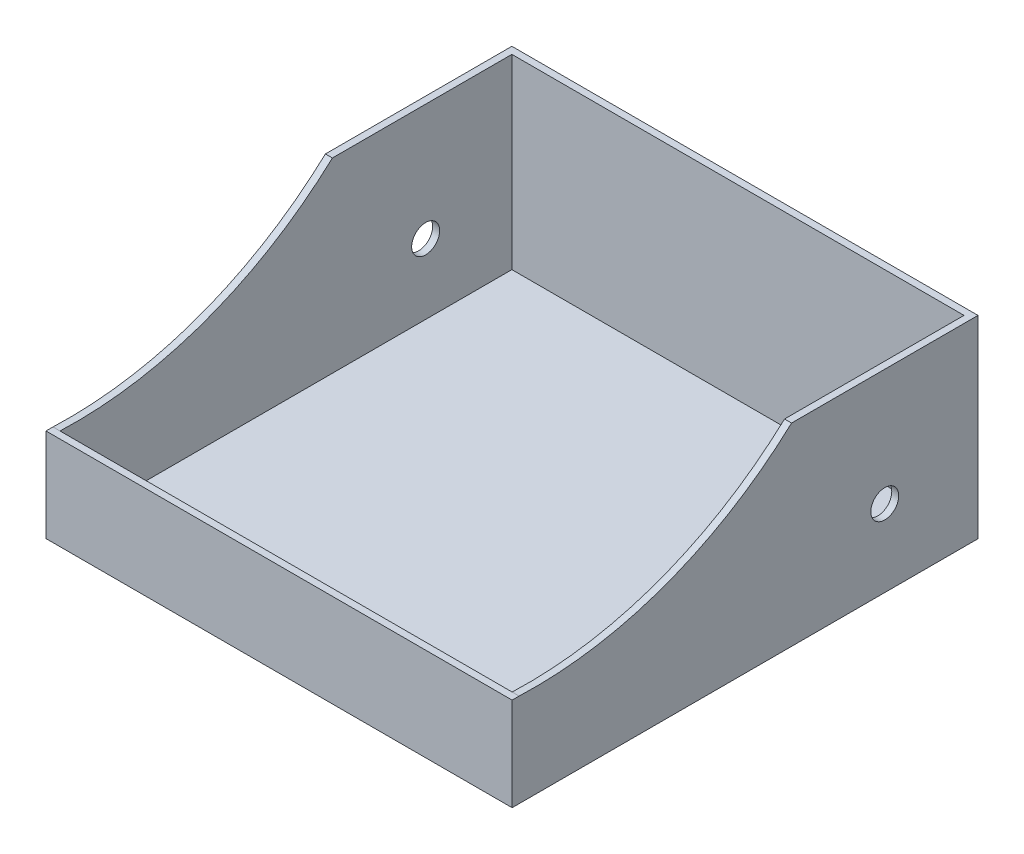
ISO-10303-21;
HEADER;
FILE_DESCRIPTION(('STEP AP214'),'2;1');
FILE_NAME('part.step','',(''),(''),'','','');
FILE_SCHEMA(('AUTOMOTIVE_DESIGN { 1 0 10303 214 1 1 1 1 }'));
ENDSEC;
DATA;
#1=APPLICATION_CONTEXT('core data for automotive mechanical design processes');
#2=APPLICATION_PROTOCOL_DEFINITION('international standard','automotive_design',2000,#1);
#3=PRODUCT_CONTEXT('',#1,'mechanical');
#4=PRODUCT('Part','Part','',(#3));
#5=PRODUCT_RELATED_PRODUCT_CATEGORY('part','',(#4));
#6=PRODUCT_DEFINITION_FORMATION('','',#4);
#7=PRODUCT_DEFINITION_CONTEXT('part definition',#1,'design');
#8=PRODUCT_DEFINITION('design','',#6,#7);
#9=PRODUCT_DEFINITION_SHAPE('','',#8);
#10=(LENGTH_UNIT() NAMED_UNIT(*) SI_UNIT(.MILLI.,.METRE.));
#11=(NAMED_UNIT(*) PLANE_ANGLE_UNIT() SI_UNIT($,.RADIAN.));
#12=(NAMED_UNIT(*) SI_UNIT($,.STERADIAN.) SOLID_ANGLE_UNIT());
#13=UNCERTAINTY_MEASURE_WITH_UNIT(LENGTH_MEASURE(1.E-05),#10,'distance_accuracy_value','');
#14=(GEOMETRIC_REPRESENTATION_CONTEXT(3) GLOBAL_UNCERTAINTY_ASSIGNED_CONTEXT((#13)) GLOBAL_UNIT_ASSIGNED_CONTEXT((#10,
#11,#12)) REPRESENTATION_CONTEXT('',''));
#15=CARTESIAN_POINT('',(0.,0.,0.));
#16=DIRECTION('',(0.,0.,1.));
#17=DIRECTION('',(1.,0.,0.));
#18=AXIS2_PLACEMENT_3D('',#15,#16,#17);
#19=CARTESIAN_POINT('',(0.,3.,0.));
#20=DIRECTION('',(0.,1.,0.));
#21=DIRECTION('',(0.,0.,1.));
#22=AXIS2_PLACEMENT_3D('',#19,#20,#21);
#23=PLANE('',#22);
#24=DIRECTION('',(0.,0.,1.));
#25=VECTOR('',#24,1.);
#26=CARTESIAN_POINT('',(97.,3.,-99.949));
#27=LINE('',#26,#25);
#28=CARTESIAN_POINT('',(97.,3.,-96.949));
#29=VERTEX_POINT('',#28);
#30=CARTESIAN_POINT('',(97.,3.,96.949));
#31=VERTEX_POINT('',#30);
#32=EDGE_CURVE('E209',#29,#31,#27,.T.);
#33=ORIENTED_EDGE('',*,*,#32,.F.);
#34=DIRECTION('',(-1.,0.,0.));
#35=VECTOR('',#34,1.);
#36=CARTESIAN_POINT('',(0.,3.,-96.949));
#37=LINE('',#36,#35);
#38=CARTESIAN_POINT('',(-97.,3.,-96.949));
#39=VERTEX_POINT('',#38);
#40=EDGE_CURVE('E139',#29,#39,#37,.T.);
#41=ORIENTED_EDGE('',*,*,#40,.T.);
#42=DIRECTION('',(0.,0.,-1.));
#43=VECTOR('',#42,1.);
#44=CARTESIAN_POINT('',(-97.,3.,-99.949));
#45=LINE('',#44,#43);
#46=CARTESIAN_POINT('',(-97.,3.,96.949));
#47=VERTEX_POINT('',#46);
#48=EDGE_CURVE('E137',#47,#39,#45,.T.);
#49=ORIENTED_EDGE('',*,*,#48,.F.);
#50=DIRECTION('',(1.,0.,0.));
#51=VECTOR('',#50,1.);
#52=CARTESIAN_POINT('',(0.,3.,96.949));
#53=LINE('',#52,#51);
#54=EDGE_CURVE('E206',#47,#31,#53,.T.);
#55=ORIENTED_EDGE('',*,*,#54,.T.);
#56=EDGE_LOOP('',(#33,#41,#49,#55));
#57=FACE_BOUND('',#56,.T.);
#58=ADVANCED_FACE('F39',(#57),#23,.T.);
#59=CARTESIAN_POINT('',(-97.,83.,-99.949));
#60=DIRECTION('',(-1.,0.,0.));
#61=DIRECTION('',(0.,0.,1.));
#62=AXIS2_PLACEMENT_3D('',#59,#60,#61);
#63=PLANE('',#62);
#64=CARTESIAN_POINT('',(-97.,33.,-59.949));
#65=DIRECTION('',(-1.,0.,0.));
#66=DIRECTION('',(0.,0.,1.));
#67=AXIS2_PLACEMENT_3D('',#64,#65,#66);
#68=CIRCLE('',#67,5.99999999999999);
#69=CARTESIAN_POINT('',(-97.,33.,-53.949));
#70=VERTEX_POINT('',#69);
#71=EDGE_CURVE('E138',#70,#70,#68,.T.);
#72=ORIENTED_EDGE('',*,*,#71,.T.);
#73=EDGE_LOOP('',(#72));
#74=FACE_BOUND('',#73,.T.);
#75=DIRECTION('',(0.,-1.,0.));
#76=VECTOR('',#75,1.);
#77=CARTESIAN_POINT('',(-97.,83.,-96.949));
#78=LINE('',#77,#76);
#79=CARTESIAN_POINT('',(-97.,83.,-96.949));
#80=VERTEX_POINT('',#79);
#81=EDGE_CURVE('E124',#80,#39,#78,.T.);
#82=ORIENTED_EDGE('',*,*,#81,.F.);
#83=DIRECTION('',(0.,0.,-1.));
#84=VECTOR('',#83,1.);
#85=CARTESIAN_POINT('',(-97.,83.,-99.949));
#86=LINE('',#85,#84);
#87=CARTESIAN_POINT('',(-97.,83.,-19.949));
#88=VERTEX_POINT('',#87);
#89=EDGE_CURVE('E135',#88,#80,#86,.T.);
#90=ORIENTED_EDGE('',*,*,#89,.F.);
#91=CARTESIAN_POINT('',(-97.,202.608368507145,90.4055915910214));
#92=DIRECTION('',(-1.,0.,0.));
#93=DIRECTION('',(0.,0.,1.));
#94=AXIS2_PLACEMENT_3D('',#91,#92,#93);
#95=CIRCLE('',#94,162.739969590024);
#96=CARTESIAN_POINT('',(-97.,40.,96.9489999999999));
#97=VERTEX_POINT('',#96);
#98=EDGE_CURVE('E226',#88,#97,#95,.T.);
#99=ORIENTED_EDGE('',*,*,#98,.T.);
#100=DIRECTION('',(0.,-1.,0.));
#101=VECTOR('',#100,1.);
#102=CARTESIAN_POINT('',(-97.,40.,96.949));
#103=LINE('',#102,#101);
#104=EDGE_CURVE('E235',#97,#47,#103,.T.);
#105=ORIENTED_EDGE('',*,*,#104,.T.);
#106=ORIENTED_EDGE('',*,*,#48,.T.);
#107=EDGE_LOOP('',(#82,#90,#99,#105,#106));
#108=FACE_BOUND('',#107,.T.);
#109=ADVANCED_FACE('F133',(#74,#108),#63,.F.);
#110=CARTESIAN_POINT('',(97.,83.,-99.949));
#111=DIRECTION('',(1.,0.,0.));
#112=DIRECTION('',(0.,0.,-1.));
#113=AXIS2_PLACEMENT_3D('',#110,#111,#112);
#114=PLANE('',#113);
#115=CARTESIAN_POINT('',(97.,33.,-59.949));
#116=DIRECTION('',(1.,0.,0.));
#117=DIRECTION('',(0.,0.,-1.));
#118=AXIS2_PLACEMENT_3D('',#115,#116,#117);
#119=CIRCLE('',#118,6.);
#120=CARTESIAN_POINT('',(97.,33.,-65.949));
#121=VERTEX_POINT('',#120);
#122=EDGE_CURVE('E43',#121,#121,#119,.T.);
#123=ORIENTED_EDGE('',*,*,#122,.T.);
#124=EDGE_LOOP('',(#123));
#125=FACE_BOUND('',#124,.T.);
#126=DIRECTION('',(0.,1.,0.));
#127=VECTOR('',#126,1.);
#128=CARTESIAN_POINT('',(97.,83.,-96.949));
#129=LINE('',#128,#127);
#130=CARTESIAN_POINT('',(97.,83.,-96.949));
#131=VERTEX_POINT('',#130);
#132=EDGE_CURVE('E127',#29,#131,#129,.T.);
#133=ORIENTED_EDGE('',*,*,#132,.F.);
#134=ORIENTED_EDGE('',*,*,#32,.T.);
#135=DIRECTION('',(0.,1.,0.));
#136=VECTOR('',#135,1.);
#137=CARTESIAN_POINT('',(97.,0.,96.949));
#138=LINE('',#137,#136);
#139=CARTESIAN_POINT('',(97.,40.,96.949));
#140=VERTEX_POINT('',#139);
#141=EDGE_CURVE('E227',#31,#140,#138,.T.);
#142=ORIENTED_EDGE('',*,*,#141,.T.);
#143=CARTESIAN_POINT('',(97.,202.608368507146,90.4055915910218));
#144=DIRECTION('',(1.,0.,0.));
#145=DIRECTION('',(0.,0.,-1.));
#146=AXIS2_PLACEMENT_3D('',#143,#144,#145);
#147=CIRCLE('',#146,162.739969590026);
#148=CARTESIAN_POINT('',(97.,83.,-19.949));
#149=VERTEX_POINT('',#148);
#150=EDGE_CURVE('E63',#149,#140,#147,.F.);
#151=ORIENTED_EDGE('',*,*,#150,.F.);
#152=DIRECTION('',(0.,0.,1.));
#153=VECTOR('',#152,1.);
#154=CARTESIAN_POINT('',(97.,83.,-99.949));
#155=LINE('',#154,#153);
#156=EDGE_CURVE('E218',#131,#149,#155,.T.);
#157=ORIENTED_EDGE('',*,*,#156,.F.);
#158=EDGE_LOOP('',(#133,#134,#142,#151,#157));
#159=FACE_BOUND('',#158,.T.);
#160=ADVANCED_FACE('F273',(#125,#159),#114,.F.);
#161=CARTESIAN_POINT('',(100.,40.,96.949));
#162=DIRECTION('',(0.,0.,1.));
#163=DIRECTION('',(1.,0.,0.));
#164=AXIS2_PLACEMENT_3D('',#161,#162,#163);
#165=PLANE('',#164);
#166=ORIENTED_EDGE('',*,*,#141,.F.);
#167=ORIENTED_EDGE('',*,*,#54,.F.);
#168=ORIENTED_EDGE('',*,*,#104,.F.);
#169=DIRECTION('',(-1.,0.,0.));
#170=VECTOR('',#169,1.);
#171=CARTESIAN_POINT('',(100.,40.,96.949));
#172=LINE('',#171,#170);
#173=EDGE_CURVE('E197',#140,#97,#172,.T.);
#174=ORIENTED_EDGE('',*,*,#173,.F.);
#175=EDGE_LOOP('',(#166,#167,#168,#174));
#176=FACE_BOUND('',#175,.T.);
#177=ADVANCED_FACE('F243',(#176),#165,.F.);
#178=CARTESIAN_POINT('',(100.,3.,-99.949));
#179=DIRECTION('',(-1.,0.,0.));
#180=DIRECTION('',(0.,0.,1.));
#181=AXIS2_PLACEMENT_3D('',#178,#179,#180);
#182=PLANE('',#181);
#183=DIRECTION('',(0.,-1.,0.));
#184=VECTOR('',#183,1.);
#185=CARTESIAN_POINT('',(100.,3.,-99.949));
#186=LINE('',#185,#184);
#187=CARTESIAN_POINT('',(100.,83.,-99.949));
#188=VERTEX_POINT('',#187);
#189=CARTESIAN_POINT('',(100.,0.,-99.949));
#190=VERTEX_POINT('',#189);
#191=EDGE_CURVE('E11',#188,#190,#186,.T.);
#192=ORIENTED_EDGE('',*,*,#191,.F.);
#193=DIRECTION('',(0.,0.,-1.));
#194=VECTOR('',#193,1.);
#195=CARTESIAN_POINT('',(100.,83.,-99.949));
#196=LINE('',#195,#194);
#197=CARTESIAN_POINT('',(100.,83.,-19.949));
#198=VERTEX_POINT('',#197);
#199=EDGE_CURVE('E215',#198,#188,#196,.T.);
#200=ORIENTED_EDGE('',*,*,#199,.F.);
#201=CARTESIAN_POINT('',(100.,202.608368507146,90.4055915910218));
#202=DIRECTION('',(1.,0.,0.));
#203=DIRECTION('',(0.,0.,-1.));
#204=AXIS2_PLACEMENT_3D('',#201,#202,#203);
#205=CIRCLE('',#204,162.739969590026);
#206=CARTESIAN_POINT('',(100.,40.,96.949));
#207=VERTEX_POINT('',#206);
#208=EDGE_CURVE('E194',#198,#207,#205,.F.);
#209=ORIENTED_EDGE('',*,*,#208,.T.);
#210=DIRECTION('',(0.,0.,-1.));
#211=VECTOR('',#210,1.);
#212=CARTESIAN_POINT('',(100.,40.,99.949));
#213=LINE('',#212,#211);
#214=CARTESIAN_POINT('',(100.,40.,99.949));
#215=VERTEX_POINT('',#214);
#216=EDGE_CURVE('E191',#215,#207,#213,.T.);
#217=ORIENTED_EDGE('',*,*,#216,.F.);
#218=DIRECTION('',(0.,-1.,0.));
#219=VECTOR('',#218,1.);
#220=CARTESIAN_POINT('',(100.,3.,99.949));
#221=LINE('',#220,#219);
#222=CARTESIAN_POINT('',(100.,0.,99.949));
#223=VERTEX_POINT('',#222);
#224=EDGE_CURVE('E163',#215,#223,#221,.T.);
#225=ORIENTED_EDGE('',*,*,#224,.T.);
#226=DIRECTION('',(0.,0.,-1.));
#227=VECTOR('',#226,1.);
#228=CARTESIAN_POINT('',(100.,0.,-99.949));
#229=LINE('',#228,#227);
#230=EDGE_CURVE('E148',#223,#190,#229,.T.);
#231=ORIENTED_EDGE('',*,*,#230,.T.);
#232=EDGE_LOOP('',(#192,#200,#209,#217,#225,#231));
#233=FACE_BOUND('',#232,.T.);
#234=CARTESIAN_POINT('',(100.,33.,-59.949));
#235=DIRECTION('',(-1.,0.,0.));
#236=DIRECTION('',(0.,0.,1.));
#237=AXIS2_PLACEMENT_3D('',#234,#235,#236);
#238=CIRCLE('',#237,6.);
#239=CARTESIAN_POINT('',(100.,33.,-53.949));
#240=VERTEX_POINT('',#239);
#241=EDGE_CURVE('E198',#240,#240,#238,.T.);
#242=ORIENTED_EDGE('',*,*,#241,.T.);
#243=EDGE_LOOP('',(#242));
#244=FACE_BOUND('',#243,.T.);
#245=ADVANCED_FACE('F41',(#233,#244),#182,.F.);
#246=CARTESIAN_POINT('',(-100.,3.,-99.949));
#247=DIRECTION('',(0.,0.,1.));
#248=DIRECTION('',(1.,0.,0.));
#249=AXIS2_PLACEMENT_3D('',#246,#247,#248);
#250=PLANE('',#249);
#251=DIRECTION('',(-1.,0.,0.));
#252=VECTOR('',#251,1.);
#253=CARTESIAN_POINT('',(-100.,83.,-99.949));
#254=LINE('',#253,#252);
#255=CARTESIAN_POINT('',(-100.,83.,-99.949));
#256=VERTEX_POINT('',#255);
#257=EDGE_CURVE('E145',#188,#256,#254,.T.);
#258=ORIENTED_EDGE('',*,*,#257,.F.);
#259=ORIENTED_EDGE('',*,*,#191,.T.);
#260=DIRECTION('',(-1.,0.,0.));
#261=VECTOR('',#260,1.);
#262=CARTESIAN_POINT('',(-100.,0.,-99.949));
#263=LINE('',#262,#261);
#264=CARTESIAN_POINT('',(-100.,0.,-99.949));
#265=VERTEX_POINT('',#264);
#266=EDGE_CURVE('E157',#190,#265,#263,.T.);
#267=ORIENTED_EDGE('',*,*,#266,.T.);
#268=DIRECTION('',(0.,-1.,0.));
#269=VECTOR('',#268,1.);
#270=CARTESIAN_POINT('',(-100.,3.,-99.949));
#271=LINE('',#270,#269);
#272=EDGE_CURVE('E48',#256,#265,#271,.T.);
#273=ORIENTED_EDGE('',*,*,#272,.F.);
#274=EDGE_LOOP('',(#258,#259,#267,#273));
#275=FACE_BOUND('',#274,.T.);
#276=ADVANCED_FACE('F283',(#275),#250,.F.);
#277=CARTESIAN_POINT('',(-100.,3.,-99.949));
#278=DIRECTION('',(1.,0.,0.));
#279=DIRECTION('',(0.,0.,-1.));
#280=AXIS2_PLACEMENT_3D('',#277,#278,#279);
#281=PLANE('',#280);
#282=DIRECTION('',(0.,0.,1.));
#283=VECTOR('',#282,1.);
#284=CARTESIAN_POINT('',(-100.,0.,-99.949));
#285=LINE('',#284,#283);
#286=CARTESIAN_POINT('',(-100.,0.,99.949));
#287=VERTEX_POINT('',#286);
#288=EDGE_CURVE('E159',#265,#287,#285,.T.);
#289=ORIENTED_EDGE('',*,*,#288,.T.);
#290=DIRECTION('',(0.,-1.,0.));
#291=VECTOR('',#290,1.);
#292=CARTESIAN_POINT('',(-100.,3.,99.949));
#293=LINE('',#292,#291);
#294=CARTESIAN_POINT('',(-100.,40.,99.949));
#295=VERTEX_POINT('',#294);
#296=EDGE_CURVE('E166',#295,#287,#293,.T.);
#297=ORIENTED_EDGE('',*,*,#296,.F.);
#298=DIRECTION('',(0.,0.,-1.));
#299=VECTOR('',#298,1.);
#300=CARTESIAN_POINT('',(-100.,40.,99.949));
#301=LINE('',#300,#299);
#302=CARTESIAN_POINT('',(-100.,40.,96.949));
#303=VERTEX_POINT('',#302);
#304=EDGE_CURVE('E205',#295,#303,#301,.T.);
#305=ORIENTED_EDGE('',*,*,#304,.T.);
#306=CARTESIAN_POINT('',(-100.,202.608368507145,90.4055915910214));
#307=DIRECTION('',(-1.,0.,0.));
#308=DIRECTION('',(0.,0.,1.));
#309=AXIS2_PLACEMENT_3D('',#306,#307,#308);
#310=CIRCLE('',#309,162.739969590024);
#311=CARTESIAN_POINT('',(-100.,83.,-19.949));
#312=VERTEX_POINT('',#311);
#313=EDGE_CURVE('E225',#312,#303,#310,.T.);
#314=ORIENTED_EDGE('',*,*,#313,.F.);
#315=DIRECTION('',(0.,0.,1.));
#316=VECTOR('',#315,1.);
#317=CARTESIAN_POINT('',(-100.,83.,-99.949));
#318=LINE('',#317,#316);
#319=EDGE_CURVE('E150',#256,#312,#318,.T.);
#320=ORIENTED_EDGE('',*,*,#319,.F.);
#321=ORIENTED_EDGE('',*,*,#272,.T.);
#322=EDGE_LOOP('',(#289,#297,#305,#314,#320,#321));
#323=FACE_BOUND('',#322,.T.);
#324=CARTESIAN_POINT('',(-100.,33.,-59.949));
#325=DIRECTION('',(1.,0.,0.));
#326=DIRECTION('',(0.,0.,-1.));
#327=AXIS2_PLACEMENT_3D('',#324,#325,#326);
#328=CIRCLE('',#327,5.99999999999999);
#329=CARTESIAN_POINT('',(-100.,33.,-65.949));
#330=VERTEX_POINT('',#329);
#331=EDGE_CURVE('E251',#330,#330,#328,.T.);
#332=ORIENTED_EDGE('',*,*,#331,.T.);
#333=EDGE_LOOP('',(#332));
#334=FACE_BOUND('',#333,.T.);
#335=ADVANCED_FACE('F173',(#323,#334),#281,.F.);
#336=CARTESIAN_POINT('',(-100.,3.,99.949));
#337=DIRECTION('',(0.,0.,-1.));
#338=DIRECTION('',(-1.,0.,0.));
#339=AXIS2_PLACEMENT_3D('',#336,#337,#338);
#340=PLANE('',#339);
#341=DIRECTION('',(1.,0.,0.));
#342=VECTOR('',#341,1.);
#343=CARTESIAN_POINT('',(-100.,0.,99.949));
#344=LINE('',#343,#342);
#345=EDGE_CURVE('E161',#287,#223,#344,.T.);
#346=ORIENTED_EDGE('',*,*,#345,.T.);
#347=ORIENTED_EDGE('',*,*,#224,.F.);
#348=DIRECTION('',(-1.,0.,0.));
#349=VECTOR('',#348,1.);
#350=CARTESIAN_POINT('',(100.,40.,99.949));
#351=LINE('',#350,#349);
#352=EDGE_CURVE('E201',#215,#295,#351,.T.);
#353=ORIENTED_EDGE('',*,*,#352,.T.);
#354=ORIENTED_EDGE('',*,*,#296,.T.);
#355=EDGE_LOOP('',(#346,#347,#353,#354));
#356=FACE_BOUND('',#355,.T.);
#357=ADVANCED_FACE('F184',(#356),#340,.F.);
#358=CARTESIAN_POINT('',(0.,0.,0.));
#359=DIRECTION('',(0.,1.,0.));
#360=DIRECTION('',(0.,0.,1.));
#361=AXIS2_PLACEMENT_3D('',#358,#359,#360);
#362=PLANE('',#361);
#363=ORIENTED_EDGE('',*,*,#266,.F.);
#364=ORIENTED_EDGE('',*,*,#230,.F.);
#365=ORIENTED_EDGE('',*,*,#345,.F.);
#366=ORIENTED_EDGE('',*,*,#288,.F.);
#367=EDGE_LOOP('',(#363,#364,#365,#366));
#368=FACE_BOUND('',#367,.T.);
#369=ADVANCED_FACE('F181',(#368),#362,.F.);
#370=CARTESIAN_POINT('',(0.,83.,0.));
#371=DIRECTION('',(0.,1.,0.));
#372=DIRECTION('',(0.,0.,1.));
#373=AXIS2_PLACEMENT_3D('',#370,#371,#372);
#374=PLANE('',#373);
#375=ORIENTED_EDGE('',*,*,#319,.T.);
#376=DIRECTION('',(1.,0.,0.));
#377=VECTOR('',#376,1.);
#378=CARTESIAN_POINT('',(-100.,83.,-19.949));
#379=LINE('',#378,#377);
#380=EDGE_CURVE('E144',#312,#88,#379,.T.);
#381=ORIENTED_EDGE('',*,*,#380,.T.);
#382=ORIENTED_EDGE('',*,*,#89,.T.);
#383=DIRECTION('',(1.,0.,0.));
#384=VECTOR('',#383,1.);
#385=CARTESIAN_POINT('',(-100.,83.,-96.949));
#386=LINE('',#385,#384);
#387=EDGE_CURVE('E55',#80,#131,#386,.T.);
#388=ORIENTED_EDGE('',*,*,#387,.T.);
#389=ORIENTED_EDGE('',*,*,#156,.T.);
#390=DIRECTION('',(1.,0.,0.));
#391=VECTOR('',#390,1.);
#392=CARTESIAN_POINT('',(100.,83.,-19.949));
#393=LINE('',#392,#391);
#394=EDGE_CURVE('E155',#149,#198,#393,.T.);
#395=ORIENTED_EDGE('',*,*,#394,.T.);
#396=ORIENTED_EDGE('',*,*,#199,.T.);
#397=ORIENTED_EDGE('',*,*,#257,.T.);
#398=EDGE_LOOP('',(#375,#381,#382,#388,#389,#395,#396,#397));
#399=FACE_BOUND('',#398,.T.);
#400=ADVANCED_FACE('F142',(#399),#374,.T.);
#401=CARTESIAN_POINT('',(0.,40.,0.));
#402=DIRECTION('',(0.,1.,0.));
#403=DIRECTION('',(0.,0.,1.));
#404=AXIS2_PLACEMENT_3D('',#401,#402,#403);
#405=PLANE('',#404);
#406=ORIENTED_EDGE('',*,*,#304,.F.);
#407=ORIENTED_EDGE('',*,*,#352,.F.);
#408=ORIENTED_EDGE('',*,*,#216,.T.);
#409=EDGE_CURVE('E211',#207,#140,#172,.T.);
#410=ORIENTED_EDGE('',*,*,#409,.T.);
#411=ORIENTED_EDGE('',*,*,#173,.T.);
#412=DIRECTION('',(-1.,0.,0.));
#413=VECTOR('',#412,1.);
#414=CARTESIAN_POINT('',(-97.,40.,96.9489999999999));
#415=LINE('',#414,#413);
#416=EDGE_CURVE('E229',#97,#303,#415,.T.);
#417=ORIENTED_EDGE('',*,*,#416,.T.);
#418=EDGE_LOOP('',(#406,#407,#408,#410,#411,#417));
#419=FACE_BOUND('',#418,.T.);
#420=ADVANCED_FACE('F202',(#419),#405,.T.);
#421=CARTESIAN_POINT('',(128.956,33.,-59.949));
#422=DIRECTION('',(-1.,0.,0.));
#423=DIRECTION('',(0.,0.,1.));
#424=AXIS2_PLACEMENT_3D('',#421,#422,#423);
#425=CYLINDRICAL_SURFACE('',#424,6.);
#426=ORIENTED_EDGE('',*,*,#122,.F.);
#427=EDGE_LOOP('',(#426));
#428=FACE_BOUND('',#427,.T.);
#429=ORIENTED_EDGE('',*,*,#241,.F.);
#430=EDGE_LOOP('',(#429));
#431=FACE_BOUND('',#430,.T.);
#432=ADVANCED_FACE('F302',(#428,#431),#425,.F.);
#433=CARTESIAN_POINT('',(-97.,202.608368507145,90.4055915910214));
#434=DIRECTION('',(-1.,0.,0.));
#435=DIRECTION('',(0.,0.,1.));
#436=AXIS2_PLACEMENT_3D('',#433,#434,#435);
#437=CYLINDRICAL_SURFACE('',#436,162.739969590024);
#438=ORIENTED_EDGE('',*,*,#313,.T.);
#439=ORIENTED_EDGE('',*,*,#416,.F.);
#440=ORIENTED_EDGE('',*,*,#98,.F.);
#441=ORIENTED_EDGE('',*,*,#380,.F.);
#442=EDGE_LOOP('',(#438,#439,#440,#441));
#443=FACE_BOUND('',#442,.T.);
#444=ADVANCED_FACE('F223',(#443),#437,.F.);
#445=CARTESIAN_POINT('',(97.,202.608368507146,90.4055915910218));
#446=DIRECTION('',(1.,0.,0.));
#447=DIRECTION('',(0.,0.,-1.));
#448=AXIS2_PLACEMENT_3D('',#445,#446,#447);
#449=CYLINDRICAL_SURFACE('',#448,162.739969590026);
#450=ORIENTED_EDGE('',*,*,#208,.F.);
#451=ORIENTED_EDGE('',*,*,#394,.F.);
#452=ORIENTED_EDGE('',*,*,#150,.T.);
#453=ORIENTED_EDGE('',*,*,#409,.F.);
#454=EDGE_LOOP('',(#450,#451,#452,#453));
#455=FACE_BOUND('',#454,.T.);
#456=ADVANCED_FACE('F258',(#455),#449,.F.);
#457=CARTESIAN_POINT('',(-125.25,33.,-59.949));
#458=DIRECTION('',(1.,0.,0.));
#459=DIRECTION('',(0.,0.,-1.));
#460=AXIS2_PLACEMENT_3D('',#457,#458,#459);
#461=CYLINDRICAL_SURFACE('',#460,5.99999999999999);
#462=ORIENTED_EDGE('',*,*,#71,.F.);
#463=EDGE_LOOP('',(#462));
#464=FACE_BOUND('',#463,.T.);
#465=ORIENTED_EDGE('',*,*,#331,.F.);
#466=EDGE_LOOP('',(#465));
#467=FACE_BOUND('',#466,.T.);
#468=ADVANCED_FACE('F256',(#464,#467),#461,.F.);
#469=CARTESIAN_POINT('',(-100.,83.,-96.949));
#470=DIRECTION('',(0.,0.,-1.));
#471=DIRECTION('',(-1.,0.,0.));
#472=AXIS2_PLACEMENT_3D('',#469,#470,#471);
#473=PLANE('',#472);
#474=ORIENTED_EDGE('',*,*,#387,.F.);
#475=ORIENTED_EDGE('',*,*,#81,.T.);
#476=ORIENTED_EDGE('',*,*,#40,.F.);
#477=ORIENTED_EDGE('',*,*,#132,.T.);
#478=EDGE_LOOP('',(#474,#475,#476,#477));
#479=FACE_BOUND('',#478,.T.);
#480=ADVANCED_FACE('F123',(#479),#473,.F.);
#481=CLOSED_SHELL('',(#58,#109,#160,#177,#245,#276,#335,#357,#369,#400,#420,#432,#444,#456,#468,#480));
#482=MANIFOLD_SOLID_BREP('B2',#481);
#483=ADVANCED_BREP_SHAPE_REPRESENTATION('',(#18,#482),#14);
#484=SHAPE_DEFINITION_REPRESENTATION(#9,#483);
ENDSEC;
END-ISO-10303-21;
